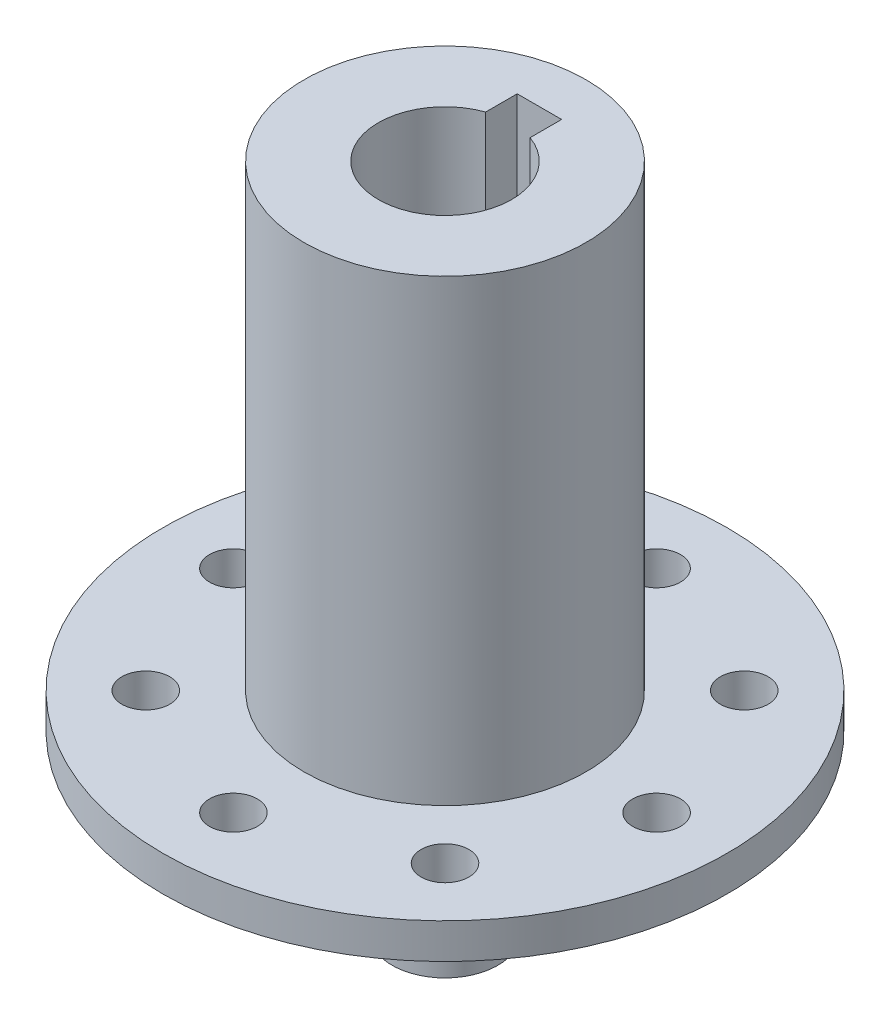
ISO-10303-21;
HEADER;
FILE_DESCRIPTION(('STEP AP214'),'2;1');
FILE_NAME('part.step','',(''),(''),'','','');
FILE_SCHEMA(('AUTOMOTIVE_DESIGN { 1 0 10303 214 1 1 1 1 }'));
ENDSEC;
DATA;
#1=APPLICATION_CONTEXT('core data for automotive mechanical design processes');
#2=APPLICATION_PROTOCOL_DEFINITION('international standard','automotive_design',2000,#1);
#3=PRODUCT_CONTEXT('',#1,'mechanical');
#4=PRODUCT('Part','Part','',(#3));
#5=PRODUCT_RELATED_PRODUCT_CATEGORY('part','',(#4));
#6=PRODUCT_DEFINITION_FORMATION('','',#4);
#7=PRODUCT_DEFINITION_CONTEXT('part definition',#1,'design');
#8=PRODUCT_DEFINITION('design','',#6,#7);
#9=PRODUCT_DEFINITION_SHAPE('','',#8);
#10=(LENGTH_UNIT() NAMED_UNIT(*) SI_UNIT(.MILLI.,.METRE.));
#11=(NAMED_UNIT(*) PLANE_ANGLE_UNIT() SI_UNIT($,.RADIAN.));
#12=(NAMED_UNIT(*) SI_UNIT($,.STERADIAN.) SOLID_ANGLE_UNIT());
#13=UNCERTAINTY_MEASURE_WITH_UNIT(LENGTH_MEASURE(1.E-05),#10,'distance_accuracy_value','');
#14=(GEOMETRIC_REPRESENTATION_CONTEXT(3) GLOBAL_UNCERTAINTY_ASSIGNED_CONTEXT((#13)) GLOBAL_UNIT_ASSIGNED_CONTEXT((#10,
#11,#12)) REPRESENTATION_CONTEXT('',''));
#15=CARTESIAN_POINT('',(0.,0.,0.));
#16=DIRECTION('',(0.,0.,1.));
#17=DIRECTION('',(1.,0.,0.));
#18=AXIS2_PLACEMENT_3D('',#15,#16,#17);
#19=CARTESIAN_POINT('',(0.,41.275,0.));
#20=DIRECTION('',(0.,-1.,0.));
#21=DIRECTION('',(0.,0.,-1.));
#22=AXIS2_PLACEMENT_3D('',#19,#20,#21);
#23=CYLINDRICAL_SURFACE('',#22,12.7);
#24=CARTESIAN_POINT('',(0.,41.275,0.));
#25=DIRECTION('',(0.,1.,0.));
#26=DIRECTION('',(0.,0.,1.));
#27=AXIS2_PLACEMENT_3D('',#24,#25,#26);
#28=CIRCLE('',#27,12.7);
#29=CARTESIAN_POINT('',(0.,41.275,12.7));
#30=VERTEX_POINT('',#29);
#31=EDGE_CURVE('E170',#30,#30,#28,.T.);
#32=ORIENTED_EDGE('',*,*,#31,.F.);
#33=EDGE_LOOP('',(#32));
#34=FACE_BOUND('',#33,.T.);
#35=CARTESIAN_POINT('',(0.,0.,0.));
#36=DIRECTION('',(0.,1.,0.));
#37=DIRECTION('',(0.,0.,1.));
#38=AXIS2_PLACEMENT_3D('',#35,#36,#37);
#39=CIRCLE('',#38,12.7);
#40=CARTESIAN_POINT('',(0.,0.,12.7));
#41=VERTEX_POINT('',#40);
#42=EDGE_CURVE('E166',#41,#41,#39,.T.);
#43=ORIENTED_EDGE('',*,*,#42,.T.);
#44=EDGE_LOOP('',(#43));
#45=FACE_BOUND('',#44,.T.);
#46=ADVANCED_FACE('F45',(#34,#45),#23,.T.);
#47=CARTESIAN_POINT('',(0.,41.275,0.));
#48=DIRECTION('',(0.,1.,0.));
#49=DIRECTION('',(0.,0.,1.));
#50=AXIS2_PLACEMENT_3D('',#47,#48,#49);
#51=PLANE('',#50);
#52=CARTESIAN_POINT('',(0.,41.275,0.));
#53=DIRECTION('',(0.,1.,0.));
#54=DIRECTION('',(0.,0.,1.));
#55=AXIS2_PLACEMENT_3D('',#52,#53,#54);
#56=CIRCLE('',#55,6.);
#57=CARTESIAN_POINT('',(-2.,41.275,-5.65685424949238));
#58=VERTEX_POINT('',#57);
#59=CARTESIAN_POINT('',(2.,41.275,-5.65685424949238));
#60=VERTEX_POINT('',#59);
#61=EDGE_CURVE('E60',#58,#60,#56,.T.);
#62=ORIENTED_EDGE('',*,*,#61,.F.);
#63=DIRECTION('',(0.,0.,1.));
#64=VECTOR('',#63,1.);
#65=CARTESIAN_POINT('',(-2.,41.275,-8.5));
#66=LINE('',#65,#64);
#67=CARTESIAN_POINT('',(-2.,41.275,-8.5));
#68=VERTEX_POINT('',#67);
#69=EDGE_CURVE('E111',#68,#58,#66,.T.);
#70=ORIENTED_EDGE('',*,*,#69,.F.);
#71=DIRECTION('',(-1.,0.,0.));
#72=VECTOR('',#71,1.);
#73=CARTESIAN_POINT('',(-2.,41.275,-8.5));
#74=LINE('',#73,#72);
#75=CARTESIAN_POINT('',(2.,41.275,-8.5));
#76=VERTEX_POINT('',#75);
#77=EDGE_CURVE('E119',#76,#68,#74,.T.);
#78=ORIENTED_EDGE('',*,*,#77,.F.);
#79=DIRECTION('',(0.,0.,-1.));
#80=VECTOR('',#79,1.);
#81=CARTESIAN_POINT('',(2.,41.275,-8.5));
#82=LINE('',#81,#80);
#83=EDGE_CURVE('E95',#60,#76,#82,.T.);
#84=ORIENTED_EDGE('',*,*,#83,.F.);
#85=EDGE_LOOP('',(#62,#70,#78,#84));
#86=FACE_BOUND('',#85,.T.);
#87=ORIENTED_EDGE('',*,*,#31,.T.);
#88=EDGE_LOOP('',(#87));
#89=FACE_BOUND('',#88,.T.);
#90=ADVANCED_FACE('F200',(#86,#89),#51,.T.);
#91=CARTESIAN_POINT('',(0.,-3.175,0.));
#92=DIRECTION('',(0.,1.,0.));
#93=DIRECTION('',(0.,0.,1.));
#94=AXIS2_PLACEMENT_3D('',#91,#92,#93);
#95=CYLINDRICAL_SURFACE('',#94,25.4);
#96=CARTESIAN_POINT('',(0.,-3.175,0.));
#97=DIRECTION('',(0.,-1.,0.));
#98=DIRECTION('',(0.,0.,-1.));
#99=AXIS2_PLACEMENT_3D('',#96,#97,#98);
#100=CIRCLE('',#99,25.4);
#101=CARTESIAN_POINT('',(0.,-3.175,-25.4));
#102=VERTEX_POINT('',#101);
#103=EDGE_CURVE('E163',#102,#102,#100,.T.);
#104=ORIENTED_EDGE('',*,*,#103,.F.);
#105=EDGE_LOOP('',(#104));
#106=FACE_BOUND('',#105,.T.);
#107=CARTESIAN_POINT('',(0.,0.,0.));
#108=DIRECTION('',(0.,-1.,0.));
#109=DIRECTION('',(0.,0.,-1.));
#110=AXIS2_PLACEMENT_3D('',#107,#108,#109);
#111=CIRCLE('',#110,25.4);
#112=CARTESIAN_POINT('',(0.,0.,-25.4));
#113=VERTEX_POINT('',#112);
#114=EDGE_CURVE('E167',#113,#113,#111,.T.);
#115=ORIENTED_EDGE('',*,*,#114,.T.);
#116=EDGE_LOOP('',(#115));
#117=FACE_BOUND('',#116,.T.);
#118=ADVANCED_FACE('F205',(#106,#117),#95,.T.);
#119=CARTESIAN_POINT('',(0.,-3.175,0.));
#120=DIRECTION('',(0.,-1.,0.));
#121=DIRECTION('',(0.,0.,-1.));
#122=AXIS2_PLACEMENT_3D('',#119,#120,#121);
#123=PLANE('',#122);
#124=CARTESIAN_POINT('',(0.,-3.175,0.));
#125=DIRECTION('',(0.,-1.,0.));
#126=DIRECTION('',(0.,0.,-1.));
#127=AXIS2_PLACEMENT_3D('',#124,#125,#126);
#128=CIRCLE('',#127,9.7625);
#129=CARTESIAN_POINT('',(0.,-3.175,-9.7625));
#130=VERTEX_POINT('',#129);
#131=EDGE_CURVE('E13',#130,#130,#128,.F.);
#132=ORIENTED_EDGE('',*,*,#131,.T.);
#133=EDGE_LOOP('',(#132));
#134=FACE_BOUND('',#133,.T.);
#135=CARTESIAN_POINT('',(0.,-3.175,-19.05));
#136=DIRECTION('',(0.,-1.,0.));
#137=DIRECTION('',(0.,0.,-1.));
#138=AXIS2_PLACEMENT_3D('',#135,#136,#137);
#139=CIRCLE('',#138,2.15264999999999);
#140=CARTESIAN_POINT('',(0.,-3.175,-21.20265));
#141=VERTEX_POINT('',#140);
#142=EDGE_CURVE('E123',#141,#141,#139,.T.);
#143=ORIENTED_EDGE('',*,*,#142,.F.);
#144=EDGE_LOOP('',(#143));
#145=FACE_BOUND('',#144,.T.);
#146=CARTESIAN_POINT('',(13.4703841816038,-3.175,-13.4703841816037));
#147=DIRECTION('',(0.,-1.,0.));
#148=DIRECTION('',(0.,0.,-1.));
#149=AXIS2_PLACEMENT_3D('',#146,#147,#148);
#150=CIRCLE('',#149,2.15265);
#151=CARTESIAN_POINT('',(13.4703841816038,-3.175,-15.6230341816037));
#152=VERTEX_POINT('',#151);
#153=EDGE_CURVE('E129',#152,#152,#150,.T.);
#154=ORIENTED_EDGE('',*,*,#153,.F.);
#155=EDGE_LOOP('',(#154));
#156=FACE_BOUND('',#155,.T.);
#157=CARTESIAN_POINT('',(19.05,-3.175,0.));
#158=DIRECTION('',(0.,-1.,0.));
#159=DIRECTION('',(0.,0.,-1.));
#160=AXIS2_PLACEMENT_3D('',#157,#158,#159);
#161=CIRCLE('',#160,2.15265);
#162=CARTESIAN_POINT('',(19.05,-3.175,-2.15264999999999));
#163=VERTEX_POINT('',#162);
#164=EDGE_CURVE('E135',#163,#163,#161,.T.);
#165=ORIENTED_EDGE('',*,*,#164,.F.);
#166=EDGE_LOOP('',(#165));
#167=FACE_BOUND('',#166,.T.);
#168=CARTESIAN_POINT('',(13.4703841816037,-3.175,13.4703841816038));
#169=DIRECTION('',(0.,-1.,0.));
#170=DIRECTION('',(0.,0.,-1.));
#171=AXIS2_PLACEMENT_3D('',#168,#169,#170);
#172=CIRCLE('',#171,2.15265);
#173=CARTESIAN_POINT('',(13.4703841816037,-3.175,11.3177341816038));
#174=VERTEX_POINT('',#173);
#175=EDGE_CURVE('E139',#174,#174,#172,.T.);
#176=ORIENTED_EDGE('',*,*,#175,.F.);
#177=EDGE_LOOP('',(#176));
#178=FACE_BOUND('',#177,.T.);
#179=CARTESIAN_POINT('',(0.,-3.175,19.05));
#180=DIRECTION('',(0.,-1.,0.));
#181=DIRECTION('',(0.,0.,-1.));
#182=AXIS2_PLACEMENT_3D('',#179,#180,#181);
#183=CIRCLE('',#182,2.15264999999999);
#184=CARTESIAN_POINT('',(0.,-3.175,16.89735));
#185=VERTEX_POINT('',#184);
#186=EDGE_CURVE('E145',#185,#185,#183,.T.);
#187=ORIENTED_EDGE('',*,*,#186,.F.);
#188=EDGE_LOOP('',(#187));
#189=FACE_BOUND('',#188,.T.);
#190=CARTESIAN_POINT('',(-13.4703841816038,-3.175,13.4703841816037));
#191=DIRECTION('',(0.,-1.,0.));
#192=DIRECTION('',(0.,0.,-1.));
#193=AXIS2_PLACEMENT_3D('',#190,#191,#192);
#194=CIRCLE('',#193,2.15265);
#195=CARTESIAN_POINT('',(-13.4703841816038,-3.175,11.3177341816037));
#196=VERTEX_POINT('',#195);
#197=EDGE_CURVE('E149',#196,#196,#194,.T.);
#198=ORIENTED_EDGE('',*,*,#197,.F.);
#199=EDGE_LOOP('',(#198));
#200=FACE_BOUND('',#199,.T.);
#201=CARTESIAN_POINT('',(-19.05,-3.175,0.));
#202=DIRECTION('',(0.,-1.,0.));
#203=DIRECTION('',(0.,0.,-1.));
#204=AXIS2_PLACEMENT_3D('',#201,#202,#203);
#205=CIRCLE('',#204,2.15265);
#206=CARTESIAN_POINT('',(-19.05,-3.175,-2.15265));
#207=VERTEX_POINT('',#206);
#208=EDGE_CURVE('E155',#207,#207,#205,.T.);
#209=ORIENTED_EDGE('',*,*,#208,.F.);
#210=EDGE_LOOP('',(#209));
#211=FACE_BOUND('',#210,.T.);
#212=CARTESIAN_POINT('',(-13.4703841816037,-3.175,-13.4703841816037));
#213=DIRECTION('',(0.,-1.,0.));
#214=DIRECTION('',(0.,0.,-1.));
#215=AXIS2_PLACEMENT_3D('',#212,#213,#214);
#216=CIRCLE('',#215,2.15265);
#217=CARTESIAN_POINT('',(-13.4703841816037,-3.175,-15.6230341816037));
#218=VERTEX_POINT('',#217);
#219=EDGE_CURVE('E159',#218,#218,#216,.T.);
#220=ORIENTED_EDGE('',*,*,#219,.F.);
#221=EDGE_LOOP('',(#220));
#222=FACE_BOUND('',#221,.T.);
#223=ORIENTED_EDGE('',*,*,#103,.T.);
#224=EDGE_LOOP('',(#223));
#225=FACE_BOUND('',#224,.T.);
#226=ADVANCED_FACE('F213',(#134,#145,#156,#167,#178,#189,#200,#211,#222,#225),#123,.T.);
#227=CARTESIAN_POINT('',(0.,0.,0.));
#228=DIRECTION('',(0.,-1.,0.));
#229=DIRECTION('',(0.,0.,-1.));
#230=AXIS2_PLACEMENT_3D('',#227,#228,#229);
#231=PLANE('',#230);
#232=CARTESIAN_POINT('',(0.,0.,-19.05));
#233=DIRECTION('',(0.,-1.,0.));
#234=DIRECTION('',(0.,0.,-1.));
#235=AXIS2_PLACEMENT_3D('',#232,#233,#234);
#236=CIRCLE('',#235,2.15264999999999);
#237=CARTESIAN_POINT('',(0.,0.,-21.20265));
#238=VERTEX_POINT('',#237);
#239=EDGE_CURVE('E128',#238,#238,#236,.T.);
#240=ORIENTED_EDGE('',*,*,#239,.T.);
#241=EDGE_LOOP('',(#240));
#242=FACE_BOUND('',#241,.T.);
#243=CARTESIAN_POINT('',(13.4703841816038,0.,-13.4703841816037));
#244=DIRECTION('',(0.,-1.,0.));
#245=DIRECTION('',(0.,0.,-1.));
#246=AXIS2_PLACEMENT_3D('',#243,#244,#245);
#247=CIRCLE('',#246,2.15264999999999);
#248=CARTESIAN_POINT('',(13.4703841816038,0.,-15.6230341816037));
#249=VERTEX_POINT('',#248);
#250=EDGE_CURVE('E132',#249,#249,#247,.T.);
#251=ORIENTED_EDGE('',*,*,#250,.T.);
#252=EDGE_LOOP('',(#251));
#253=FACE_BOUND('',#252,.T.);
#254=CARTESIAN_POINT('',(19.05,0.,0.));
#255=DIRECTION('',(0.,-1.,0.));
#256=DIRECTION('',(0.,0.,-1.));
#257=AXIS2_PLACEMENT_3D('',#254,#255,#256);
#258=CIRCLE('',#257,2.15264999999999);
#259=CARTESIAN_POINT('',(19.05,0.,-2.15264999999999));
#260=VERTEX_POINT('',#259);
#261=EDGE_CURVE('E138',#260,#260,#258,.T.);
#262=ORIENTED_EDGE('',*,*,#261,.T.);
#263=EDGE_LOOP('',(#262));
#264=FACE_BOUND('',#263,.T.);
#265=CARTESIAN_POINT('',(13.4703841816037,0.,13.4703841816038));
#266=DIRECTION('',(0.,-1.,0.));
#267=DIRECTION('',(0.,0.,-1.));
#268=AXIS2_PLACEMENT_3D('',#265,#266,#267);
#269=CIRCLE('',#268,2.15264999999999);
#270=CARTESIAN_POINT('',(13.4703841816037,0.,11.3177341816038));
#271=VERTEX_POINT('',#270);
#272=EDGE_CURVE('E142',#271,#271,#269,.T.);
#273=ORIENTED_EDGE('',*,*,#272,.T.);
#274=EDGE_LOOP('',(#273));
#275=FACE_BOUND('',#274,.T.);
#276=CARTESIAN_POINT('',(0.,0.,19.05));
#277=DIRECTION('',(0.,-1.,0.));
#278=DIRECTION('',(0.,0.,-1.));
#279=AXIS2_PLACEMENT_3D('',#276,#277,#278);
#280=CIRCLE('',#279,2.15264999999999);
#281=CARTESIAN_POINT('',(0.,0.,16.89735));
#282=VERTEX_POINT('',#281);
#283=EDGE_CURVE('E148',#282,#282,#280,.T.);
#284=ORIENTED_EDGE('',*,*,#283,.T.);
#285=EDGE_LOOP('',(#284));
#286=FACE_BOUND('',#285,.T.);
#287=CARTESIAN_POINT('',(-13.4703841816038,0.,13.4703841816037));
#288=DIRECTION('',(0.,-1.,0.));
#289=DIRECTION('',(0.,0.,-1.));
#290=AXIS2_PLACEMENT_3D('',#287,#288,#289);
#291=CIRCLE('',#290,2.15264999999999);
#292=CARTESIAN_POINT('',(-13.4703841816038,0.,11.3177341816037));
#293=VERTEX_POINT('',#292);
#294=EDGE_CURVE('E152',#293,#293,#291,.T.);
#295=ORIENTED_EDGE('',*,*,#294,.T.);
#296=EDGE_LOOP('',(#295));
#297=FACE_BOUND('',#296,.T.);
#298=CARTESIAN_POINT('',(-19.05,0.,0.));
#299=DIRECTION('',(0.,-1.,0.));
#300=DIRECTION('',(0.,0.,-1.));
#301=AXIS2_PLACEMENT_3D('',#298,#299,#300);
#302=CIRCLE('',#301,2.15264999999999);
#303=CARTESIAN_POINT('',(-19.05,0.,-2.15265));
#304=VERTEX_POINT('',#303);
#305=EDGE_CURVE('E158',#304,#304,#302,.T.);
#306=ORIENTED_EDGE('',*,*,#305,.T.);
#307=EDGE_LOOP('',(#306));
#308=FACE_BOUND('',#307,.T.);
#309=CARTESIAN_POINT('',(-13.4703841816037,0.,-13.4703841816037));
#310=DIRECTION('',(0.,-1.,0.));
#311=DIRECTION('',(0.,0.,-1.));
#312=AXIS2_PLACEMENT_3D('',#309,#310,#311);
#313=CIRCLE('',#312,2.15264999999999);
#314=CARTESIAN_POINT('',(-13.4703841816037,0.,-15.6230341816037));
#315=VERTEX_POINT('',#314);
#316=EDGE_CURVE('E162',#315,#315,#313,.T.);
#317=ORIENTED_EDGE('',*,*,#316,.T.);
#318=EDGE_LOOP('',(#317));
#319=FACE_BOUND('',#318,.T.);
#320=ORIENTED_EDGE('',*,*,#42,.F.);
#321=EDGE_LOOP('',(#320));
#322=FACE_BOUND('',#321,.T.);
#323=ORIENTED_EDGE('',*,*,#114,.F.);
#324=EDGE_LOOP('',(#323));
#325=FACE_BOUND('',#324,.T.);
#326=ADVANCED_FACE('F215',(#242,#253,#264,#275,#286,#297,#308,#319,#322,#325),#231,.F.);
#327=CARTESIAN_POINT('',(-13.4703841816037,-3.175,-13.4703841816037));
#328=DIRECTION('',(0.,-1.,0.));
#329=DIRECTION('',(0.,0.,-1.));
#330=AXIS2_PLACEMENT_3D('',#327,#328,#329);
#331=CYLINDRICAL_SURFACE('',#330,2.15264999999999);
#332=ORIENTED_EDGE('',*,*,#219,.T.);
#333=EDGE_LOOP('',(#332));
#334=FACE_BOUND('',#333,.T.);
#335=ORIENTED_EDGE('',*,*,#316,.F.);
#336=EDGE_LOOP('',(#335));
#337=FACE_BOUND('',#336,.T.);
#338=ADVANCED_FACE('F218',(#334,#337),#331,.F.);
#339=CARTESIAN_POINT('',(-19.05,-3.175,0.));
#340=DIRECTION('',(0.,-1.,0.));
#341=DIRECTION('',(0.,0.,-1.));
#342=AXIS2_PLACEMENT_3D('',#339,#340,#341);
#343=CYLINDRICAL_SURFACE('',#342,2.15264999999999);
#344=ORIENTED_EDGE('',*,*,#208,.T.);
#345=EDGE_LOOP('',(#344));
#346=FACE_BOUND('',#345,.T.);
#347=ORIENTED_EDGE('',*,*,#305,.F.);
#348=EDGE_LOOP('',(#347));
#349=FACE_BOUND('',#348,.T.);
#350=ADVANCED_FACE('F225',(#346,#349),#343,.F.);
#351=CARTESIAN_POINT('',(-13.4703841816038,-3.175,13.4703841816037));
#352=DIRECTION('',(0.,-1.,0.));
#353=DIRECTION('',(0.,0.,-1.));
#354=AXIS2_PLACEMENT_3D('',#351,#352,#353);
#355=CYLINDRICAL_SURFACE('',#354,2.15264999999999);
#356=ORIENTED_EDGE('',*,*,#197,.T.);
#357=EDGE_LOOP('',(#356));
#358=FACE_BOUND('',#357,.T.);
#359=ORIENTED_EDGE('',*,*,#294,.F.);
#360=EDGE_LOOP('',(#359));
#361=FACE_BOUND('',#360,.T.);
#362=ADVANCED_FACE('F229',(#358,#361),#355,.F.);
#363=CARTESIAN_POINT('',(0.,-3.175,19.05));
#364=DIRECTION('',(0.,-1.,0.));
#365=DIRECTION('',(0.,0.,-1.));
#366=AXIS2_PLACEMENT_3D('',#363,#364,#365);
#367=CYLINDRICAL_SURFACE('',#366,2.15264999999999);
#368=ORIENTED_EDGE('',*,*,#186,.T.);
#369=EDGE_LOOP('',(#368));
#370=FACE_BOUND('',#369,.T.);
#371=ORIENTED_EDGE('',*,*,#283,.F.);
#372=EDGE_LOOP('',(#371));
#373=FACE_BOUND('',#372,.T.);
#374=ADVANCED_FACE('F233',(#370,#373),#367,.F.);
#375=CARTESIAN_POINT('',(13.4703841816037,-3.175,13.4703841816038));
#376=DIRECTION('',(0.,-1.,0.));
#377=DIRECTION('',(0.,0.,-1.));
#378=AXIS2_PLACEMENT_3D('',#375,#376,#377);
#379=CYLINDRICAL_SURFACE('',#378,2.15264999999999);
#380=ORIENTED_EDGE('',*,*,#175,.T.);
#381=EDGE_LOOP('',(#380));
#382=FACE_BOUND('',#381,.T.);
#383=ORIENTED_EDGE('',*,*,#272,.F.);
#384=EDGE_LOOP('',(#383));
#385=FACE_BOUND('',#384,.T.);
#386=ADVANCED_FACE('F237',(#382,#385),#379,.F.);
#387=CARTESIAN_POINT('',(19.05,-3.175,0.));
#388=DIRECTION('',(0.,-1.,0.));
#389=DIRECTION('',(0.,0.,-1.));
#390=AXIS2_PLACEMENT_3D('',#387,#388,#389);
#391=CYLINDRICAL_SURFACE('',#390,2.15264999999999);
#392=ORIENTED_EDGE('',*,*,#164,.T.);
#393=EDGE_LOOP('',(#392));
#394=FACE_BOUND('',#393,.T.);
#395=ORIENTED_EDGE('',*,*,#261,.F.);
#396=EDGE_LOOP('',(#395));
#397=FACE_BOUND('',#396,.T.);
#398=ADVANCED_FACE('F241',(#394,#397),#391,.F.);
#399=CARTESIAN_POINT('',(13.4703841816038,-3.175,-13.4703841816037));
#400=DIRECTION('',(0.,-1.,0.));
#401=DIRECTION('',(0.,0.,-1.));
#402=AXIS2_PLACEMENT_3D('',#399,#400,#401);
#403=CYLINDRICAL_SURFACE('',#402,2.15264999999999);
#404=ORIENTED_EDGE('',*,*,#153,.T.);
#405=EDGE_LOOP('',(#404));
#406=FACE_BOUND('',#405,.T.);
#407=ORIENTED_EDGE('',*,*,#250,.F.);
#408=EDGE_LOOP('',(#407));
#409=FACE_BOUND('',#408,.T.);
#410=ADVANCED_FACE('F245',(#406,#409),#403,.F.);
#411=CARTESIAN_POINT('',(0.,-3.175,-19.05));
#412=DIRECTION('',(0.,-1.,0.));
#413=DIRECTION('',(0.,0.,-1.));
#414=AXIS2_PLACEMENT_3D('',#411,#412,#413);
#415=CYLINDRICAL_SURFACE('',#414,2.15264999999999);
#416=ORIENTED_EDGE('',*,*,#142,.T.);
#417=EDGE_LOOP('',(#416));
#418=FACE_BOUND('',#417,.T.);
#419=ORIENTED_EDGE('',*,*,#239,.F.);
#420=EDGE_LOOP('',(#419));
#421=FACE_BOUND('',#420,.T.);
#422=ADVANCED_FACE('F249',(#418,#421),#415,.F.);
#423=CARTESIAN_POINT('',(0.,19.2125,0.));
#424=DIRECTION('',(0.,1.,0.));
#425=DIRECTION('',(0.,0.,1.));
#426=AXIS2_PLACEMENT_3D('',#423,#424,#425);
#427=CYLINDRICAL_SURFACE('',#426,6.);
#428=ORIENTED_EDGE('',*,*,#61,.T.);
#429=DIRECTION('',(0.,1.,0.));
#430=VECTOR('',#429,1.);
#431=CARTESIAN_POINT('',(2.,19.2125,-5.65685424949238));
#432=LINE('',#431,#430);
#433=CARTESIAN_POINT('',(2.,19.2125,-5.65685424949238));
#434=VERTEX_POINT('',#433);
#435=EDGE_CURVE('E83',#434,#60,#432,.T.);
#436=ORIENTED_EDGE('',*,*,#435,.F.);
#437=CARTESIAN_POINT('',(0.,19.2125,0.));
#438=DIRECTION('',(0.,1.,0.));
#439=DIRECTION('',(0.,0.,1.));
#440=AXIS2_PLACEMENT_3D('',#437,#438,#439);
#441=CIRCLE('',#440,6.);
#442=CARTESIAN_POINT('',(-2.,19.2125,-5.65685424949238));
#443=VERTEX_POINT('',#442);
#444=EDGE_CURVE('E109',#443,#434,#441,.T.);
#445=ORIENTED_EDGE('',*,*,#444,.F.);
#446=DIRECTION('',(0.,1.,0.));
#447=VECTOR('',#446,1.);
#448=CARTESIAN_POINT('',(-2.,19.2125,-5.65685424949238));
#449=LINE('',#448,#447);
#450=EDGE_CURVE('E68',#443,#58,#449,.T.);
#451=ORIENTED_EDGE('',*,*,#450,.T.);
#452=EDGE_LOOP('',(#428,#436,#445,#451));
#453=FACE_BOUND('',#452,.T.);
#454=ADVANCED_FACE('F253',(#453),#427,.F.);
#455=CARTESIAN_POINT('',(-2.,19.2125,-8.5));
#456=DIRECTION('',(-1.,0.,0.));
#457=DIRECTION('',(0.,0.,1.));
#458=AXIS2_PLACEMENT_3D('',#455,#456,#457);
#459=PLANE('',#458);
#460=ORIENTED_EDGE('',*,*,#69,.T.);
#461=ORIENTED_EDGE('',*,*,#450,.F.);
#462=DIRECTION('',(0.,0.,1.));
#463=VECTOR('',#462,1.);
#464=CARTESIAN_POINT('',(-2.,19.2125,-8.5));
#465=LINE('',#464,#463);
#466=CARTESIAN_POINT('',(-2.,19.2125,-8.5));
#467=VERTEX_POINT('',#466);
#468=EDGE_CURVE('E106',#467,#443,#465,.T.);
#469=ORIENTED_EDGE('',*,*,#468,.F.);
#470=DIRECTION('',(0.,1.,0.));
#471=VECTOR('',#470,1.);
#472=CARTESIAN_POINT('',(-2.,19.2125,-8.5));
#473=LINE('',#472,#471);
#474=EDGE_CURVE('E99',#467,#68,#473,.T.);
#475=ORIENTED_EDGE('',*,*,#474,.T.);
#476=EDGE_LOOP('',(#460,#461,#469,#475));
#477=FACE_BOUND('',#476,.T.);
#478=ADVANCED_FACE('F257',(#477),#459,.F.);
#479=CARTESIAN_POINT('',(-2.,19.2125,-8.5));
#480=DIRECTION('',(0.,0.,-1.));
#481=DIRECTION('',(-1.,0.,0.));
#482=AXIS2_PLACEMENT_3D('',#479,#480,#481);
#483=PLANE('',#482);
#484=ORIENTED_EDGE('',*,*,#77,.T.);
#485=ORIENTED_EDGE('',*,*,#474,.F.);
#486=DIRECTION('',(-1.,0.,0.));
#487=VECTOR('',#486,1.);
#488=CARTESIAN_POINT('',(-2.,19.2125,-8.5));
#489=LINE('',#488,#487);
#490=CARTESIAN_POINT('',(2.,19.2125,-8.5));
#491=VERTEX_POINT('',#490);
#492=EDGE_CURVE('E102',#491,#467,#489,.T.);
#493=ORIENTED_EDGE('',*,*,#492,.F.);
#494=DIRECTION('',(0.,1.,0.));
#495=VECTOR('',#494,1.);
#496=CARTESIAN_POINT('',(2.,19.2125,-8.5));
#497=LINE('',#496,#495);
#498=EDGE_CURVE('E88',#491,#76,#497,.T.);
#499=ORIENTED_EDGE('',*,*,#498,.T.);
#500=EDGE_LOOP('',(#484,#485,#493,#499));
#501=FACE_BOUND('',#500,.T.);
#502=ADVANCED_FACE('F103',(#501),#483,.F.);
#503=CARTESIAN_POINT('',(2.,19.2125,-8.5));
#504=DIRECTION('',(1.,0.,0.));
#505=DIRECTION('',(0.,0.,-1.));
#506=AXIS2_PLACEMENT_3D('',#503,#504,#505);
#507=PLANE('',#506);
#508=ORIENTED_EDGE('',*,*,#83,.T.);
#509=ORIENTED_EDGE('',*,*,#498,.F.);
#510=DIRECTION('',(0.,0.,-1.));
#511=VECTOR('',#510,1.);
#512=CARTESIAN_POINT('',(2.,19.2125,-8.5));
#513=LINE('',#512,#511);
#514=EDGE_CURVE('E92',#434,#491,#513,.T.);
#515=ORIENTED_EDGE('',*,*,#514,.F.);
#516=ORIENTED_EDGE('',*,*,#435,.T.);
#517=EDGE_LOOP('',(#508,#509,#515,#516));
#518=FACE_BOUND('',#517,.T.);
#519=ADVANCED_FACE('F90',(#518),#507,.F.);
#520=CARTESIAN_POINT('',(0.,19.2125,0.));
#521=DIRECTION('',(0.,1.,0.));
#522=DIRECTION('',(0.,0.,1.));
#523=AXIS2_PLACEMENT_3D('',#520,#521,#522);
#524=PLANE('',#523);
#525=ORIENTED_EDGE('',*,*,#444,.T.);
#526=ORIENTED_EDGE('',*,*,#514,.T.);
#527=ORIENTED_EDGE('',*,*,#492,.T.);
#528=ORIENTED_EDGE('',*,*,#468,.T.);
#529=EDGE_LOOP('',(#525,#526,#527,#528));
#530=FACE_BOUND('',#529,.T.);
#531=ADVANCED_FACE('F108',(#530),#524,.T.);
#532=CARTESIAN_POINT('',(0.,-19.05,0.));
#533=DIRECTION('',(0.,1.,0.));
#534=DIRECTION('',(0.,0.,1.));
#535=AXIS2_PLACEMENT_3D('',#532,#533,#534);
#536=CYLINDRICAL_SURFACE('',#535,4.7625);
#537=CARTESIAN_POINT('',(0.,-8.175,0.));
#538=DIRECTION('',(0.,-1.,0.));
#539=DIRECTION('',(0.,0.,-1.));
#540=AXIS2_PLACEMENT_3D('',#537,#538,#539);
#541=CIRCLE('',#540,4.7625);
#542=CARTESIAN_POINT('',(0.,-8.175,-4.7625));
#543=VERTEX_POINT('',#542);
#544=EDGE_CURVE('E53',#543,#543,#541,.T.);
#545=ORIENTED_EDGE('',*,*,#544,.T.);
#546=EDGE_LOOP('',(#545));
#547=FACE_BOUND('',#546,.T.);
#548=CARTESIAN_POINT('',(0.,-19.05,0.));
#549=DIRECTION('',(0.,-1.,0.));
#550=DIRECTION('',(0.,0.,-1.));
#551=AXIS2_PLACEMENT_3D('',#548,#549,#550);
#552=CIRCLE('',#551,4.7625);
#553=CARTESIAN_POINT('',(0.,-19.05,-4.7625));
#554=VERTEX_POINT('',#553);
#555=EDGE_CURVE('E117',#554,#554,#552,.T.);
#556=ORIENTED_EDGE('',*,*,#555,.F.);
#557=EDGE_LOOP('',(#556));
#558=FACE_BOUND('',#557,.T.);
#559=ADVANCED_FACE('F187',(#547,#558),#536,.T.);
#560=CARTESIAN_POINT('',(0.,-19.05,0.));
#561=DIRECTION('',(0.,-1.,0.));
#562=DIRECTION('',(0.,0.,-1.));
#563=AXIS2_PLACEMENT_3D('',#560,#561,#562);
#564=PLANE('',#563);
#565=ORIENTED_EDGE('',*,*,#555,.T.);
#566=EDGE_LOOP('',(#565));
#567=FACE_BOUND('',#566,.T.);
#568=ADVANCED_FACE('F191',(#567),#564,.T.);
#569=CARTESIAN_POINT('',(0.,-8.175,0.));
#570=DIRECTION('',(0.,-1.,0.));
#571=DIRECTION('',(0.,0.,-1.));
#572=AXIS2_PLACEMENT_3D('',#569,#570,#571);
#573=TOROIDAL_SURFACE('',#572,9.7625,5.);
#574=ORIENTED_EDGE('',*,*,#131,.F.);
#575=EDGE_LOOP('',(#574));
#576=FACE_BOUND('',#575,.T.);
#577=ORIENTED_EDGE('',*,*,#544,.F.);
#578=EDGE_LOOP('',(#577));
#579=FACE_BOUND('',#578,.T.);
#580=ADVANCED_FACE('F47',(#576,#579),#573,.F.);
#581=CLOSED_SHELL('',(#46,#90,#118,#226,#326,#338,#350,#362,#374,#386,#398,#410,#422,#454,#478,
#502,#519,#531,#559,#568,#580));
#582=MANIFOLD_SOLID_BREP('B2',#581);
#583=ADVANCED_BREP_SHAPE_REPRESENTATION('',(#18,#582),#14);
#584=SHAPE_DEFINITION_REPRESENTATION(#9,#583);
ENDSEC;
END-ISO-10303-21;
